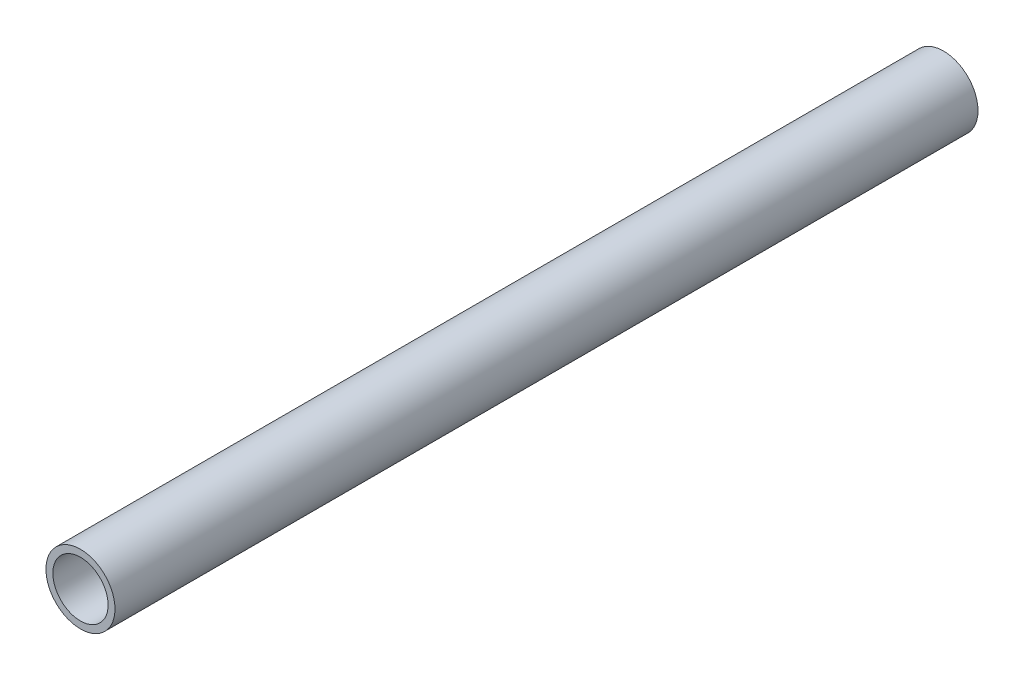
ISO-10303-21;
HEADER;
FILE_DESCRIPTION(('STEP AP214'),'2;1');
FILE_NAME('part.step','',(''),(''),'','','');
FILE_SCHEMA(('AUTOMOTIVE_DESIGN { 1 0 10303 214 1 1 1 1 }'));
ENDSEC;
DATA;
#1=APPLICATION_CONTEXT('core data for automotive mechanical design processes');
#2=APPLICATION_PROTOCOL_DEFINITION('international standard','automotive_design',2000,#1);
#3=PRODUCT_CONTEXT('',#1,'mechanical');
#4=PRODUCT('Part','Part','',(#3));
#5=PRODUCT_RELATED_PRODUCT_CATEGORY('part','',(#4));
#6=PRODUCT_DEFINITION_FORMATION('','',#4);
#7=PRODUCT_DEFINITION_CONTEXT('part definition',#1,'design');
#8=PRODUCT_DEFINITION('design','',#6,#7);
#9=PRODUCT_DEFINITION_SHAPE('','',#8);
#10=(LENGTH_UNIT() NAMED_UNIT(*) SI_UNIT(.MILLI.,.METRE.));
#11=(NAMED_UNIT(*) PLANE_ANGLE_UNIT() SI_UNIT($,.RADIAN.));
#12=(NAMED_UNIT(*) SI_UNIT($,.STERADIAN.) SOLID_ANGLE_UNIT());
#13=UNCERTAINTY_MEASURE_WITH_UNIT(LENGTH_MEASURE(1.E-05),#10,'distance_accuracy_value','');
#14=(GEOMETRIC_REPRESENTATION_CONTEXT(3) GLOBAL_UNCERTAINTY_ASSIGNED_CONTEXT((#13)) GLOBAL_UNIT_ASSIGNED_CONTEXT((#10,
#11,#12)) REPRESENTATION_CONTEXT('',''));
#15=CARTESIAN_POINT('',(0.,0.,0.));
#16=DIRECTION('',(0.,0.,1.));
#17=DIRECTION('',(1.,0.,0.));
#18=AXIS2_PLACEMENT_3D('',#15,#16,#17);
#19=CARTESIAN_POINT('',(0.,0.,317.5));
#20=DIRECTION('',(0.,0.,1.));
#21=DIRECTION('',(1.,0.,0.));
#22=AXIS2_PLACEMENT_3D('',#19,#20,#21);
#23=PLANE('',#22);
#24=CARTESIAN_POINT('',(0.,0.,317.5));
#25=DIRECTION('',(0.,0.,1.));
#26=DIRECTION('',(1.,0.,0.));
#27=AXIS2_PLACEMENT_3D('',#24,#25,#26);
#28=CIRCLE('',#27,12.7);
#29=CARTESIAN_POINT('',(12.7,0.,317.5));
#30=VERTEX_POINT('',#29);
#31=EDGE_CURVE('E10',#30,#30,#28,.T.);
#32=ORIENTED_EDGE('',*,*,#31,.T.);
#33=EDGE_LOOP('',(#32));
#34=FACE_BOUND('',#33,.T.);
#35=CARTESIAN_POINT('',(0.,0.,317.5));
#36=DIRECTION('',(0.,0.,1.));
#37=DIRECTION('',(1.,0.,0.));
#38=AXIS2_PLACEMENT_3D('',#35,#36,#37);
#39=CIRCLE('',#38,10.16);
#40=CARTESIAN_POINT('',(10.16,0.,317.5));
#41=VERTEX_POINT('',#40);
#42=EDGE_CURVE('E42',#41,#41,#39,.T.);
#43=ORIENTED_EDGE('',*,*,#42,.F.);
#44=EDGE_LOOP('',(#43));
#45=FACE_BOUND('',#44,.T.);
#46=ADVANCED_FACE('F31',(#34,#45),#23,.T.);
#47=CARTESIAN_POINT('',(0.,0.,0.));
#48=DIRECTION('',(0.,0.,1.));
#49=DIRECTION('',(1.,0.,0.));
#50=AXIS2_PLACEMENT_3D('',#47,#48,#49);
#51=PLANE('',#50);
#52=CARTESIAN_POINT('',(0.,0.,0.));
#53=DIRECTION('',(0.,0.,1.));
#54=DIRECTION('',(1.,0.,0.));
#55=AXIS2_PLACEMENT_3D('',#52,#53,#54);
#56=CIRCLE('',#55,12.7);
#57=CARTESIAN_POINT('',(12.7,0.,0.));
#58=VERTEX_POINT('',#57);
#59=EDGE_CURVE('E35',#58,#58,#56,.T.);
#60=ORIENTED_EDGE('',*,*,#59,.F.);
#61=EDGE_LOOP('',(#60));
#62=FACE_BOUND('',#61,.T.);
#63=CARTESIAN_POINT('',(0.,0.,0.));
#64=DIRECTION('',(0.,0.,1.));
#65=DIRECTION('',(1.,0.,0.));
#66=AXIS2_PLACEMENT_3D('',#63,#64,#65);
#67=CIRCLE('',#66,10.16);
#68=CARTESIAN_POINT('',(10.16,0.,0.));
#69=VERTEX_POINT('',#68);
#70=EDGE_CURVE('E44',#69,#69,#67,.T.);
#71=ORIENTED_EDGE('',*,*,#70,.T.);
#72=EDGE_LOOP('',(#71));
#73=FACE_BOUND('',#72,.T.);
#74=ADVANCED_FACE('F54',(#62,#73),#51,.F.);
#75=CARTESIAN_POINT('',(0.,0.,317.5));
#76=DIRECTION('',(0.,0.,-1.));
#77=DIRECTION('',(-1.,0.,0.));
#78=AXIS2_PLACEMENT_3D('',#75,#76,#77);
#79=CYLINDRICAL_SURFACE('',#78,12.7);
#80=ORIENTED_EDGE('',*,*,#31,.F.);
#81=EDGE_LOOP('',(#80));
#82=FACE_BOUND('',#81,.T.);
#83=ORIENTED_EDGE('',*,*,#59,.T.);
#84=EDGE_LOOP('',(#83));
#85=FACE_BOUND('',#84,.T.);
#86=ADVANCED_FACE('F33',(#82,#85),#79,.T.);
#87=CARTESIAN_POINT('',(0.,0.,317.5));
#88=DIRECTION('',(0.,0.,-1.));
#89=DIRECTION('',(-1.,0.,0.));
#90=AXIS2_PLACEMENT_3D('',#87,#88,#89);
#91=CYLINDRICAL_SURFACE('',#90,10.16);
#92=ORIENTED_EDGE('',*,*,#42,.T.);
#93=EDGE_LOOP('',(#92));
#94=FACE_BOUND('',#93,.T.);
#95=ORIENTED_EDGE('',*,*,#70,.F.);
#96=EDGE_LOOP('',(#95));
#97=FACE_BOUND('',#96,.T.);
#98=ADVANCED_FACE('F50',(#94,#97),#91,.F.);
#99=CLOSED_SHELL('',(#46,#74,#86,#98));
#100=MANIFOLD_SOLID_BREP('B2',#99);
#101=ADVANCED_BREP_SHAPE_REPRESENTATION('',(#18,#100),#14);
#102=SHAPE_DEFINITION_REPRESENTATION(#9,#101);
ENDSEC;
END-ISO-10303-21;
